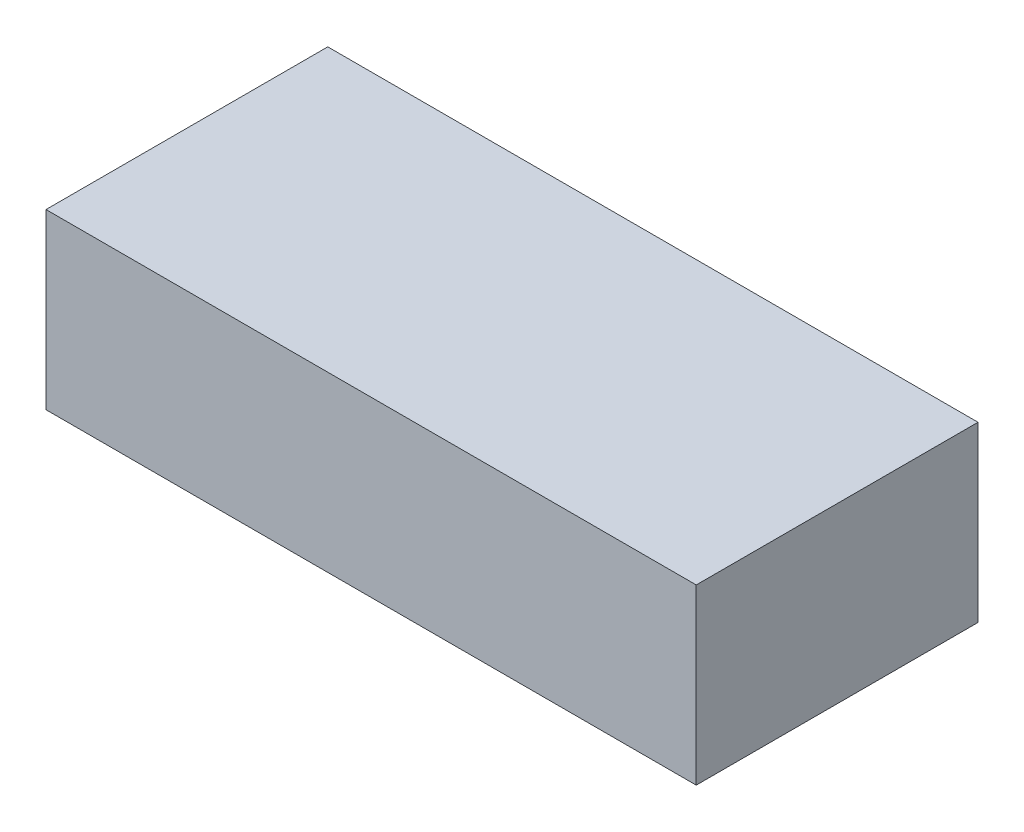
ISO-10303-21;
HEADER;
FILE_DESCRIPTION(('STEP AP214'),'2;1');
FILE_NAME('part.step','',(''),(''),'','','');
FILE_SCHEMA(('AUTOMOTIVE_DESIGN { 1 0 10303 214 1 1 1 1 }'));
ENDSEC;
DATA;
#1=APPLICATION_CONTEXT('core data for automotive mechanical design processes');
#2=APPLICATION_PROTOCOL_DEFINITION('international standard','automotive_design',2000,#1);
#3=PRODUCT_CONTEXT('',#1,'mechanical');
#4=PRODUCT('Part','Part','',(#3));
#5=PRODUCT_RELATED_PRODUCT_CATEGORY('part','',(#4));
#6=PRODUCT_DEFINITION_FORMATION('','',#4);
#7=PRODUCT_DEFINITION_CONTEXT('part definition',#1,'design');
#8=PRODUCT_DEFINITION('design','',#6,#7);
#9=PRODUCT_DEFINITION_SHAPE('','',#8);
#10=(LENGTH_UNIT() NAMED_UNIT(*) SI_UNIT(.MILLI.,.METRE.));
#11=(NAMED_UNIT(*) PLANE_ANGLE_UNIT() SI_UNIT($,.RADIAN.));
#12=(NAMED_UNIT(*) SI_UNIT($,.STERADIAN.) SOLID_ANGLE_UNIT());
#13=UNCERTAINTY_MEASURE_WITH_UNIT(LENGTH_MEASURE(1.E-05),#10,'distance_accuracy_value','');
#14=(GEOMETRIC_REPRESENTATION_CONTEXT(3) GLOBAL_UNCERTAINTY_ASSIGNED_CONTEXT((#13)) GLOBAL_UNIT_ASSIGNED_CONTEXT((#10,
#11,#12)) REPRESENTATION_CONTEXT('',''));
#15=CARTESIAN_POINT('',(0.,0.,0.));
#16=DIRECTION('',(0.,0.,1.));
#17=DIRECTION('',(1.,0.,0.));
#18=AXIS2_PLACEMENT_3D('',#15,#16,#17);
#19=CARTESIAN_POINT('',(75.,40.,32.5));
#20=DIRECTION('',(-1.,0.,0.));
#21=DIRECTION('',(0.,0.,1.));
#22=AXIS2_PLACEMENT_3D('',#19,#20,#21);
#23=PLANE('',#22);
#24=DIRECTION('',(0.,0.,-1.));
#25=VECTOR('',#24,1.);
#26=CARTESIAN_POINT('',(75.,0.,32.5));
#27=LINE('',#26,#25);
#28=CARTESIAN_POINT('',(75.,0.,32.5));
#29=VERTEX_POINT('',#28);
#30=CARTESIAN_POINT('',(75.,0.,-32.5));
#31=VERTEX_POINT('',#30);
#32=EDGE_CURVE('E169',#29,#31,#27,.T.);
#33=ORIENTED_EDGE('',*,*,#32,.T.);
#34=DIRECTION('',(0.,-1.,0.));
#35=VECTOR('',#34,1.);
#36=CARTESIAN_POINT('',(75.,40.,-32.5));
#37=LINE('',#36,#35);
#38=CARTESIAN_POINT('',(75.,40.,-32.5));
#39=VERTEX_POINT('',#38);
#40=EDGE_CURVE('E11',#39,#31,#37,.T.);
#41=ORIENTED_EDGE('',*,*,#40,.F.);
#42=DIRECTION('',(0.,0.,-1.));
#43=VECTOR('',#42,1.);
#44=CARTESIAN_POINT('',(75.,40.,32.5));
#45=LINE('',#44,#43);
#46=CARTESIAN_POINT('',(75.,40.,32.5));
#47=VERTEX_POINT('',#46);
#48=EDGE_CURVE('E175',#47,#39,#45,.T.);
#49=ORIENTED_EDGE('',*,*,#48,.F.);
#50=DIRECTION('',(0.,-1.,0.));
#51=VECTOR('',#50,1.);
#52=CARTESIAN_POINT('',(75.,40.,32.5));
#53=LINE('',#52,#51);
#54=EDGE_CURVE('E185',#47,#29,#53,.T.);
#55=ORIENTED_EDGE('',*,*,#54,.T.);
#56=EDGE_LOOP('',(#33,#41,#49,#55));
#57=FACE_BOUND('',#56,.T.);
#58=ADVANCED_FACE('F46',(#57),#23,.F.);
#59=CARTESIAN_POINT('',(-75.,40.,-32.5));
#60=DIRECTION('',(0.,0.,1.));
#61=DIRECTION('',(1.,0.,0.));
#62=AXIS2_PLACEMENT_3D('',#59,#60,#61);
#63=PLANE('',#62);
#64=CARTESIAN_POINT('',(-38.12,12.19,-32.5));
#65=DIRECTION('',(0.,0.,-1.));
#66=DIRECTION('',(-1.,0.,0.));
#67=AXIS2_PLACEMENT_3D('',#64,#65,#66);
#68=CIRCLE('',#67,4.33);
#69=CARTESIAN_POINT('',(-42.45,12.19,-32.5));
#70=VERTEX_POINT('',#69);
#71=EDGE_CURVE('E236',#70,#70,#68,.T.);
#72=ORIENTED_EDGE('',*,*,#71,.F.);
#73=EDGE_LOOP('',(#72));
#74=FACE_BOUND('',#73,.T.);
#75=DIRECTION('',(-1.,0.,0.));
#76=VECTOR('',#75,1.);
#77=CARTESIAN_POINT('',(-75.,0.,-32.5));
#78=LINE('',#77,#76);
#79=CARTESIAN_POINT('',(-75.,0.,-32.5));
#80=VERTEX_POINT('',#79);
#81=EDGE_CURVE('E189',#31,#80,#78,.T.);
#82=ORIENTED_EDGE('',*,*,#81,.T.);
#83=DIRECTION('',(0.,-1.,0.));
#84=VECTOR('',#83,1.);
#85=CARTESIAN_POINT('',(-75.,40.,-32.5));
#86=LINE('',#85,#84);
#87=CARTESIAN_POINT('',(-75.,40.,-32.5));
#88=VERTEX_POINT('',#87);
#89=EDGE_CURVE('E54',#88,#80,#86,.T.);
#90=ORIENTED_EDGE('',*,*,#89,.F.);
#91=DIRECTION('',(-1.,0.,0.));
#92=VECTOR('',#91,1.);
#93=CARTESIAN_POINT('',(-75.,40.,-32.5));
#94=LINE('',#93,#92);
#95=EDGE_CURVE('E98',#39,#88,#94,.T.);
#96=ORIENTED_EDGE('',*,*,#95,.F.);
#97=ORIENTED_EDGE('',*,*,#40,.T.);
#98=EDGE_LOOP('',(#82,#90,#96,#97));
#99=FACE_BOUND('',#98,.T.);
#100=ADVANCED_FACE('F224',(#74,#99),#63,.F.);
#101=CARTESIAN_POINT('',(-75.,40.,32.5));
#102=DIRECTION('',(1.,0.,0.));
#103=DIRECTION('',(0.,0.,-1.));
#104=AXIS2_PLACEMENT_3D('',#101,#102,#103);
#105=PLANE('',#104);
#106=DIRECTION('',(0.,0.,1.));
#107=VECTOR('',#106,1.);
#108=CARTESIAN_POINT('',(-75.,0.,32.5));
#109=LINE('',#108,#107);
#110=CARTESIAN_POINT('',(-75.,0.,32.5));
#111=VERTEX_POINT('',#110);
#112=EDGE_CURVE('E192',#80,#111,#109,.T.);
#113=ORIENTED_EDGE('',*,*,#112,.T.);
#114=DIRECTION('',(0.,-1.,0.));
#115=VECTOR('',#114,1.);
#116=CARTESIAN_POINT('',(-75.,40.,32.5));
#117=LINE('',#116,#115);
#118=CARTESIAN_POINT('',(-75.,40.,32.5));
#119=VERTEX_POINT('',#118);
#120=EDGE_CURVE('E199',#119,#111,#117,.T.);
#121=ORIENTED_EDGE('',*,*,#120,.F.);
#122=DIRECTION('',(0.,0.,1.));
#123=VECTOR('',#122,1.);
#124=CARTESIAN_POINT('',(-75.,40.,32.5));
#125=LINE('',#124,#123);
#126=EDGE_CURVE('E180',#88,#119,#125,.T.);
#127=ORIENTED_EDGE('',*,*,#126,.F.);
#128=ORIENTED_EDGE('',*,*,#89,.T.);
#129=EDGE_LOOP('',(#113,#121,#127,#128));
#130=FACE_BOUND('',#129,.T.);
#131=ADVANCED_FACE('F207',(#130),#105,.F.);
#132=CARTESIAN_POINT('',(-75.,40.,32.5));
#133=DIRECTION('',(0.,0.,-1.));
#134=DIRECTION('',(-1.,0.,0.));
#135=AXIS2_PLACEMENT_3D('',#132,#133,#134);
#136=PLANE('',#135);
#137=DIRECTION('',(1.,0.,0.));
#138=VECTOR('',#137,1.);
#139=CARTESIAN_POINT('',(-75.,0.,32.5));
#140=LINE('',#139,#138);
#141=EDGE_CURVE('E91',#111,#29,#140,.T.);
#142=ORIENTED_EDGE('',*,*,#141,.T.);
#143=ORIENTED_EDGE('',*,*,#54,.F.);
#144=DIRECTION('',(1.,0.,0.));
#145=VECTOR('',#144,1.);
#146=CARTESIAN_POINT('',(-75.,40.,32.5));
#147=LINE('',#146,#145);
#148=EDGE_CURVE('E70',#119,#47,#147,.T.);
#149=ORIENTED_EDGE('',*,*,#148,.F.);
#150=ORIENTED_EDGE('',*,*,#120,.T.);
#151=EDGE_LOOP('',(#142,#143,#149,#150));
#152=FACE_BOUND('',#151,.T.);
#153=ADVANCED_FACE('F215',(#152),#136,.F.);
#154=CARTESIAN_POINT('',(0.,40.,0.));
#155=DIRECTION('',(0.,-1.,0.));
#156=DIRECTION('',(0.,0.,-1.));
#157=AXIS2_PLACEMENT_3D('',#154,#155,#156);
#158=PLANE('',#157);
#159=ORIENTED_EDGE('',*,*,#48,.T.);
#160=ORIENTED_EDGE('',*,*,#95,.T.);
#161=ORIENTED_EDGE('',*,*,#126,.T.);
#162=ORIENTED_EDGE('',*,*,#148,.T.);
#163=EDGE_LOOP('',(#159,#160,#161,#162));
#164=FACE_BOUND('',#163,.T.);
#165=ADVANCED_FACE('F217',(#164),#158,.F.);
#166=CARTESIAN_POINT('',(0.,0.,0.));
#167=DIRECTION('',(0.,-1.,0.));
#168=DIRECTION('',(0.,0.,-1.));
#169=AXIS2_PLACEMENT_3D('',#166,#167,#168);
#170=PLANE('',#169);
#171=DIRECTION('',(0.,0.,1.));
#172=VECTOR('',#171,1.);
#173=CARTESIAN_POINT('',(71.952,0.,-29.452));
#174=LINE('',#173,#172);
#175=CARTESIAN_POINT('',(71.952,0.,-29.452));
#176=VERTEX_POINT('',#175);
#177=CARTESIAN_POINT('',(71.952,0.,29.452));
#178=VERTEX_POINT('',#177);
#179=EDGE_CURVE('E61',#176,#178,#174,.T.);
#180=ORIENTED_EDGE('',*,*,#179,.F.);
#181=DIRECTION('',(1.,0.,0.));
#182=VECTOR('',#181,1.);
#183=CARTESIAN_POINT('',(-71.952,0.,-29.452));
#184=LINE('',#183,#182);
#185=CARTESIAN_POINT('',(-71.952,0.,-29.452));
#186=VERTEX_POINT('',#185);
#187=EDGE_CURVE('E143',#186,#176,#184,.T.);
#188=ORIENTED_EDGE('',*,*,#187,.F.);
#189=DIRECTION('',(0.,0.,-1.));
#190=VECTOR('',#189,1.);
#191=CARTESIAN_POINT('',(-71.952,0.,-29.452));
#192=LINE('',#191,#190);
#193=CARTESIAN_POINT('',(-71.952,0.,29.452));
#194=VERTEX_POINT('',#193);
#195=EDGE_CURVE('E148',#194,#186,#192,.T.);
#196=ORIENTED_EDGE('',*,*,#195,.F.);
#197=DIRECTION('',(-1.,0.,0.));
#198=VECTOR('',#197,1.);
#199=CARTESIAN_POINT('',(-71.952,0.,29.452));
#200=LINE('',#199,#198);
#201=EDGE_CURVE('E160',#178,#194,#200,.T.);
#202=ORIENTED_EDGE('',*,*,#201,.F.);
#203=EDGE_LOOP('',(#180,#188,#196,#202));
#204=FACE_BOUND('',#203,.T.);
#205=ORIENTED_EDGE('',*,*,#32,.F.);
#206=ORIENTED_EDGE('',*,*,#141,.F.);
#207=ORIENTED_EDGE('',*,*,#112,.F.);
#208=ORIENTED_EDGE('',*,*,#81,.F.);
#209=EDGE_LOOP('',(#205,#206,#207,#208));
#210=FACE_BOUND('',#209,.T.);
#211=ADVANCED_FACE('F211',(#204,#210),#170,.T.);
#212=CARTESIAN_POINT('',(71.952,28.4,-29.452));
#213=DIRECTION('',(1.,0.,0.));
#214=DIRECTION('',(0.,0.,-1.));
#215=AXIS2_PLACEMENT_3D('',#212,#213,#214);
#216=PLANE('',#215);
#217=ORIENTED_EDGE('',*,*,#179,.T.);
#218=DIRECTION('',(0.,-1.,0.));
#219=VECTOR('',#218,1.);
#220=CARTESIAN_POINT('',(71.952,28.4,29.452));
#221=LINE('',#220,#219);
#222=CARTESIAN_POINT('',(71.952,28.4,29.452));
#223=VERTEX_POINT('',#222);
#224=EDGE_CURVE('E118',#223,#178,#221,.T.);
#225=ORIENTED_EDGE('',*,*,#224,.F.);
#226=DIRECTION('',(0.,0.,1.));
#227=VECTOR('',#226,1.);
#228=CARTESIAN_POINT('',(71.952,28.4,-29.452));
#229=LINE('',#228,#227);
#230=CARTESIAN_POINT('',(71.952,28.4,-29.452));
#231=VERTEX_POINT('',#230);
#232=EDGE_CURVE('E122',#231,#223,#229,.T.);
#233=ORIENTED_EDGE('',*,*,#232,.F.);
#234=DIRECTION('',(0.,-1.,0.));
#235=VECTOR('',#234,1.);
#236=CARTESIAN_POINT('',(71.952,28.4,-29.452));
#237=LINE('',#236,#235);
#238=EDGE_CURVE('E166',#231,#176,#237,.T.);
#239=ORIENTED_EDGE('',*,*,#238,.T.);
#240=EDGE_LOOP('',(#217,#225,#233,#239));
#241=FACE_BOUND('',#240,.T.);
#242=ADVANCED_FACE('F120',(#241),#216,.F.);
#243=CARTESIAN_POINT('',(-71.952,28.4,-29.452));
#244=DIRECTION('',(0.,0.,-1.));
#245=DIRECTION('',(-1.,0.,0.));
#246=AXIS2_PLACEMENT_3D('',#243,#244,#245);
#247=PLANE('',#246);
#248=CARTESIAN_POINT('',(-38.12,12.19,-29.452));
#249=DIRECTION('',(0.,0.,-1.));
#250=DIRECTION('',(-1.,0.,0.));
#251=AXIS2_PLACEMENT_3D('',#248,#249,#250);
#252=CIRCLE('',#251,4.33);
#253=CARTESIAN_POINT('',(-42.45,12.19,-29.452));
#254=VERTEX_POINT('',#253);
#255=EDGE_CURVE('E151',#254,#254,#252,.F.);
#256=ORIENTED_EDGE('',*,*,#255,.F.);
#257=EDGE_LOOP('',(#256));
#258=FACE_BOUND('',#257,.T.);
#259=ORIENTED_EDGE('',*,*,#187,.T.);
#260=ORIENTED_EDGE('',*,*,#238,.F.);
#261=DIRECTION('',(1.,0.,0.));
#262=VECTOR('',#261,1.);
#263=CARTESIAN_POINT('',(-71.952,28.4,-29.452));
#264=LINE('',#263,#262);
#265=CARTESIAN_POINT('',(-71.952,28.4,-29.452));
#266=VERTEX_POINT('',#265);
#267=EDGE_CURVE('E129',#266,#231,#264,.T.);
#268=ORIENTED_EDGE('',*,*,#267,.F.);
#269=DIRECTION('',(0.,-1.,0.));
#270=VECTOR('',#269,1.);
#271=CARTESIAN_POINT('',(-71.952,28.4,-29.452));
#272=LINE('',#271,#270);
#273=EDGE_CURVE('E170',#266,#186,#272,.T.);
#274=ORIENTED_EDGE('',*,*,#273,.T.);
#275=EDGE_LOOP('',(#259,#260,#268,#274));
#276=FACE_BOUND('',#275,.T.);
#277=ADVANCED_FACE('F247',(#258,#276),#247,.F.);
#278=CARTESIAN_POINT('',(-71.952,28.4,-29.452));
#279=DIRECTION('',(-1.,0.,0.));
#280=DIRECTION('',(0.,0.,1.));
#281=AXIS2_PLACEMENT_3D('',#278,#279,#280);
#282=PLANE('',#281);
#283=ORIENTED_EDGE('',*,*,#195,.T.);
#284=ORIENTED_EDGE('',*,*,#273,.F.);
#285=DIRECTION('',(0.,0.,-1.));
#286=VECTOR('',#285,1.);
#287=CARTESIAN_POINT('',(-71.952,28.4,-29.452));
#288=LINE('',#287,#286);
#289=CARTESIAN_POINT('',(-71.952,28.4,29.452));
#290=VERTEX_POINT('',#289);
#291=EDGE_CURVE('E138',#290,#266,#288,.T.);
#292=ORIENTED_EDGE('',*,*,#291,.F.);
#293=DIRECTION('',(0.,-1.,0.));
#294=VECTOR('',#293,1.);
#295=CARTESIAN_POINT('',(-71.952,28.4,29.452));
#296=LINE('',#295,#294);
#297=EDGE_CURVE('E128',#290,#194,#296,.T.);
#298=ORIENTED_EDGE('',*,*,#297,.T.);
#299=EDGE_LOOP('',(#283,#284,#292,#298));
#300=FACE_BOUND('',#299,.T.);
#301=ADVANCED_FACE('F250',(#300),#282,.F.);
#302=CARTESIAN_POINT('',(-71.952,28.4,29.452));
#303=DIRECTION('',(0.,0.,1.));
#304=DIRECTION('',(1.,0.,0.));
#305=AXIS2_PLACEMENT_3D('',#302,#303,#304);
#306=PLANE('',#305);
#307=ORIENTED_EDGE('',*,*,#201,.T.);
#308=ORIENTED_EDGE('',*,*,#297,.F.);
#309=DIRECTION('',(-1.,0.,0.));
#310=VECTOR('',#309,1.);
#311=CARTESIAN_POINT('',(-71.952,28.4,29.452));
#312=LINE('',#311,#310);
#313=EDGE_CURVE('E132',#223,#290,#312,.T.);
#314=ORIENTED_EDGE('',*,*,#313,.F.);
#315=ORIENTED_EDGE('',*,*,#224,.T.);
#316=EDGE_LOOP('',(#307,#308,#314,#315));
#317=FACE_BOUND('',#316,.T.);
#318=ADVANCED_FACE('F133',(#317),#306,.F.);
#319=CARTESIAN_POINT('',(0.,28.4,0.));
#320=DIRECTION('',(0.,1.,0.));
#321=DIRECTION('',(0.,0.,1.));
#322=AXIS2_PLACEMENT_3D('',#319,#320,#321);
#323=PLANE('',#322);
#324=ORIENTED_EDGE('',*,*,#232,.T.);
#325=ORIENTED_EDGE('',*,*,#313,.T.);
#326=ORIENTED_EDGE('',*,*,#291,.T.);
#327=ORIENTED_EDGE('',*,*,#267,.T.);
#328=EDGE_LOOP('',(#324,#325,#326,#327));
#329=FACE_BOUND('',#328,.T.);
#330=ADVANCED_FACE('F140',(#329),#323,.F.);
#331=CARTESIAN_POINT('',(-38.12,12.19,-17.204910549849));
#332=DIRECTION('',(0.,0.,-1.));
#333=DIRECTION('',(-1.,0.,0.));
#334=AXIS2_PLACEMENT_3D('',#331,#332,#333);
#335=CYLINDRICAL_SURFACE('',#334,4.33);
#336=ORIENTED_EDGE('',*,*,#255,.T.);
#337=EDGE_LOOP('',(#336));
#338=FACE_BOUND('',#337,.T.);
#339=ORIENTED_EDGE('',*,*,#71,.T.);
#340=EDGE_LOOP('',(#339));
#341=FACE_BOUND('',#340,.T.);
#342=ADVANCED_FACE('F245',(#338,#341),#335,.F.);
#343=CLOSED_SHELL('',(#58,#100,#131,#153,#165,#211,#242,#277,#301,#318,#330,#342));
#344=MANIFOLD_SOLID_BREP('B2',#343);
#345=ADVANCED_BREP_SHAPE_REPRESENTATION('',(#18,#344),#14);
#346=SHAPE_DEFINITION_REPRESENTATION(#9,#345);
ENDSEC;
END-ISO-10303-21;
